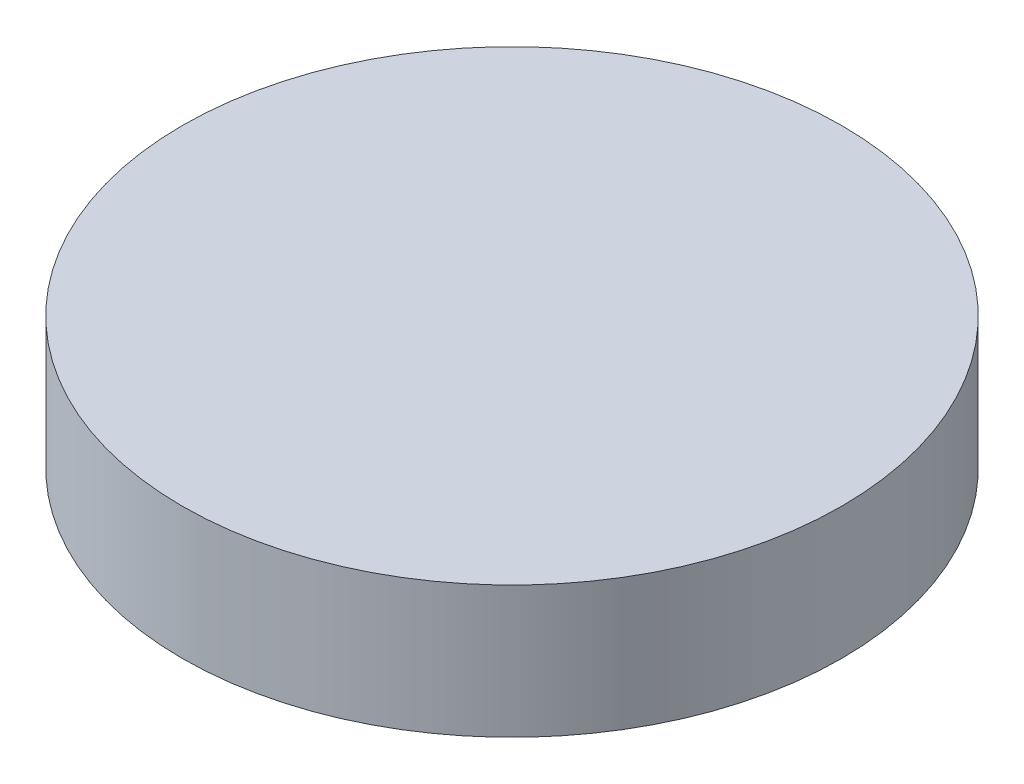
ISO-10303-21;
HEADER;
FILE_DESCRIPTION(('STEP AP214'),'2;1');
FILE_NAME('part.step','',(''),(''),'','','');
FILE_SCHEMA(('AUTOMOTIVE_DESIGN { 1 0 10303 214 1 1 1 1 }'));
ENDSEC;
DATA;
#1=APPLICATION_CONTEXT('core data for automotive mechanical design processes');
#2=APPLICATION_PROTOCOL_DEFINITION('international standard','automotive_design',2000,#1);
#3=PRODUCT_CONTEXT('',#1,'mechanical');
#4=PRODUCT('Part','Part','',(#3));
#5=PRODUCT_RELATED_PRODUCT_CATEGORY('part','',(#4));
#6=PRODUCT_DEFINITION_FORMATION('','',#4);
#7=PRODUCT_DEFINITION_CONTEXT('part definition',#1,'design');
#8=PRODUCT_DEFINITION('design','',#6,#7);
#9=PRODUCT_DEFINITION_SHAPE('','',#8);
#10=(LENGTH_UNIT() NAMED_UNIT(*) SI_UNIT(.MILLI.,.METRE.));
#11=(NAMED_UNIT(*) PLANE_ANGLE_UNIT() SI_UNIT($,.RADIAN.));
#12=(NAMED_UNIT(*) SI_UNIT($,.STERADIAN.) SOLID_ANGLE_UNIT());
#13=UNCERTAINTY_MEASURE_WITH_UNIT(LENGTH_MEASURE(1.E-05),#10,'distance_accuracy_value','');
#14=(GEOMETRIC_REPRESENTATION_CONTEXT(3) GLOBAL_UNCERTAINTY_ASSIGNED_CONTEXT((#13)) GLOBAL_UNIT_ASSIGNED_CONTEXT((#10,
#11,#12)) REPRESENTATION_CONTEXT('',''));
#15=CARTESIAN_POINT('',(0.,0.,0.));
#16=DIRECTION('',(0.,0.,1.));
#17=DIRECTION('',(1.,0.,0.));
#18=AXIS2_PLACEMENT_3D('',#15,#16,#17);
#19=CARTESIAN_POINT('',(0.,12.7,0.));
#20=DIRECTION('',(0.,-1.,0.));
#21=DIRECTION('',(0.,0.,-1.));
#22=AXIS2_PLACEMENT_3D('',#19,#20,#21);
#23=CYLINDRICAL_SURFACE('',#22,31.75);
#24=CARTESIAN_POINT('',(0.,12.7,0.));
#25=DIRECTION('',(0.,1.,0.));
#26=DIRECTION('',(0.,0.,1.));
#27=AXIS2_PLACEMENT_3D('',#24,#25,#26);
#28=CIRCLE('',#27,31.75);
#29=CARTESIAN_POINT('',(0.,12.7,31.75));
#30=VERTEX_POINT('',#29);
#31=EDGE_CURVE('E39',#30,#30,#28,.T.);
#32=ORIENTED_EDGE('',*,*,#31,.F.);
#33=EDGE_LOOP('',(#32));
#34=FACE_BOUND('',#33,.T.);
#35=CARTESIAN_POINT('',(0.,0.,0.));
#36=DIRECTION('',(0.,1.,0.));
#37=DIRECTION('',(0.,0.,1.));
#38=AXIS2_PLACEMENT_3D('',#35,#36,#37);
#39=CIRCLE('',#38,31.75);
#40=CARTESIAN_POINT('',(0.,0.,31.75));
#41=VERTEX_POINT('',#40);
#42=EDGE_CURVE('E43',#41,#41,#39,.T.);
#43=ORIENTED_EDGE('',*,*,#42,.T.);
#44=EDGE_LOOP('',(#43));
#45=FACE_BOUND('',#44,.T.);
#46=ADVANCED_FACE('F33',(#34,#45),#23,.T.);
#47=CARTESIAN_POINT('',(0.,12.7,0.));
#48=DIRECTION('',(0.,1.,0.));
#49=DIRECTION('',(0.,0.,1.));
#50=AXIS2_PLACEMENT_3D('',#47,#48,#49);
#51=PLANE('',#50);
#52=ORIENTED_EDGE('',*,*,#31,.T.);
#53=EDGE_LOOP('',(#52));
#54=FACE_BOUND('',#53,.T.);
#55=ADVANCED_FACE('F64',(#54),#51,.T.);
#56=CARTESIAN_POINT('',(0.,0.,0.));
#57=DIRECTION('',(0.,1.,0.));
#58=DIRECTION('',(0.,0.,1.));
#59=AXIS2_PLACEMENT_3D('',#56,#57,#58);
#60=PLANE('',#59);
#61=CARTESIAN_POINT('',(0.,0.,0.));
#62=DIRECTION('',(0.,1.,0.));
#63=DIRECTION('',(0.,0.,1.));
#64=AXIS2_PLACEMENT_3D('',#61,#62,#63);
#65=CIRCLE('',#64,5.588);
#66=CARTESIAN_POINT('',(0.,0.,5.588));
#67=VERTEX_POINT('',#66);
#68=EDGE_CURVE('E10',#67,#67,#65,.F.);
#69=ORIENTED_EDGE('',*,*,#68,.F.);
#70=EDGE_LOOP('',(#69));
#71=FACE_BOUND('',#70,.T.);
#72=ORIENTED_EDGE('',*,*,#42,.F.);
#73=EDGE_LOOP('',(#72));
#74=FACE_BOUND('',#73,.T.);
#75=ADVANCED_FACE('F57',(#71,#74),#60,.F.);
#76=CARTESIAN_POINT('',(0.,-12.7,0.));
#77=DIRECTION('',(0.,1.,0.));
#78=DIRECTION('',(0.,0.,1.));
#79=AXIS2_PLACEMENT_3D('',#76,#77,#78);
#80=CYLINDRICAL_SURFACE('',#79,5.588);
#81=CARTESIAN_POINT('',(0.,-12.7,0.));
#82=DIRECTION('',(0.,-1.,0.));
#83=DIRECTION('',(0.,0.,-1.));
#84=AXIS2_PLACEMENT_3D('',#81,#82,#83);
#85=CIRCLE('',#84,5.588);
#86=CARTESIAN_POINT('',(0.,-12.7,-5.588));
#87=VERTEX_POINT('',#86);
#88=EDGE_CURVE('E48',#87,#87,#85,.T.);
#89=ORIENTED_EDGE('',*,*,#88,.F.);
#90=EDGE_LOOP('',(#89));
#91=FACE_BOUND('',#90,.T.);
#92=ORIENTED_EDGE('',*,*,#68,.T.);
#93=EDGE_LOOP('',(#92));
#94=FACE_BOUND('',#93,.T.);
#95=ADVANCED_FACE('F55',(#91,#94),#80,.T.);
#96=CARTESIAN_POINT('',(0.,-12.7,0.));
#97=DIRECTION('',(0.,-1.,0.));
#98=DIRECTION('',(0.,0.,-1.));
#99=AXIS2_PLACEMENT_3D('',#96,#97,#98);
#100=PLANE('',#99);
#101=ORIENTED_EDGE('',*,*,#88,.T.);
#102=EDGE_LOOP('',(#101));
#103=FACE_BOUND('',#102,.T.);
#104=ADVANCED_FACE('F53',(#103),#100,.T.);
#105=CLOSED_SHELL('',(#46,#55,#75,#95,#104));
#106=MANIFOLD_SOLID_BREP('B2',#105);
#107=ADVANCED_BREP_SHAPE_REPRESENTATION('',(#18,#106),#14);
#108=SHAPE_DEFINITION_REPRESENTATION(#9,#107);
ENDSEC;
END-ISO-10303-21;
